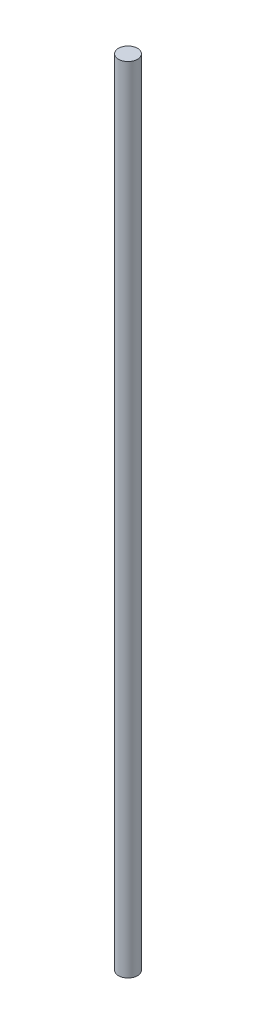
ISO-10303-21;
HEADER;
FILE_DESCRIPTION(('STEP AP214'),'2;1');
FILE_NAME('part.step','',(''),(''),'','','');
FILE_SCHEMA(('AUTOMOTIVE_DESIGN { 1 0 10303 214 1 1 1 1 }'));
ENDSEC;
DATA;
#1=APPLICATION_CONTEXT('core data for automotive mechanical design processes');
#2=APPLICATION_PROTOCOL_DEFINITION('international standard','automotive_design',2000,#1);
#3=PRODUCT_CONTEXT('',#1,'mechanical');
#4=PRODUCT('Part','Part','',(#3));
#5=PRODUCT_RELATED_PRODUCT_CATEGORY('part','',(#4));
#6=PRODUCT_DEFINITION_FORMATION('','',#4);
#7=PRODUCT_DEFINITION_CONTEXT('part definition',#1,'design');
#8=PRODUCT_DEFINITION('design','',#6,#7);
#9=PRODUCT_DEFINITION_SHAPE('','',#8);
#10=(LENGTH_UNIT() NAMED_UNIT(*) SI_UNIT(.MILLI.,.METRE.));
#11=(NAMED_UNIT(*) PLANE_ANGLE_UNIT() SI_UNIT($,.RADIAN.));
#12=(NAMED_UNIT(*) SI_UNIT($,.STERADIAN.) SOLID_ANGLE_UNIT());
#13=UNCERTAINTY_MEASURE_WITH_UNIT(LENGTH_MEASURE(1.E-05),#10,'distance_accuracy_value','');
#14=(GEOMETRIC_REPRESENTATION_CONTEXT(3) GLOBAL_UNCERTAINTY_ASSIGNED_CONTEXT((#13)) GLOBAL_UNIT_ASSIGNED_CONTEXT((#10,
#11,#12)) REPRESENTATION_CONTEXT('',''));
#15=CARTESIAN_POINT('',(0.,0.,0.));
#16=DIRECTION('',(0.,0.,1.));
#17=DIRECTION('',(1.,0.,0.));
#18=AXIS2_PLACEMENT_3D('',#15,#16,#17);
#19=CARTESIAN_POINT('',(0.,250.,0.));
#20=DIRECTION('',(0.,-1.,0.));
#21=DIRECTION('',(0.,0.,-1.));
#22=AXIS2_PLACEMENT_3D('',#19,#20,#21);
#23=CYLINDRICAL_SURFACE('',#22,3.);
#24=CARTESIAN_POINT('',(0.,250.,0.));
#25=DIRECTION('',(0.,1.,0.));
#26=DIRECTION('',(0.,0.,1.));
#27=AXIS2_PLACEMENT_3D('',#24,#25,#26);
#28=CIRCLE('',#27,3.);
#29=CARTESIAN_POINT('',(0.,250.,3.));
#30=VERTEX_POINT('',#29);
#31=EDGE_CURVE('E10',#30,#30,#28,.T.);
#32=ORIENTED_EDGE('',*,*,#31,.F.);
#33=EDGE_LOOP('',(#32));
#34=FACE_BOUND('',#33,.T.);
#35=CARTESIAN_POINT('',(0.,0.,0.));
#36=DIRECTION('',(0.,1.,0.));
#37=DIRECTION('',(0.,0.,1.));
#38=AXIS2_PLACEMENT_3D('',#35,#36,#37);
#39=CIRCLE('',#38,3.);
#40=CARTESIAN_POINT('',(0.,0.,3.));
#41=VERTEX_POINT('',#40);
#42=EDGE_CURVE('E42',#41,#41,#39,.T.);
#43=ORIENTED_EDGE('',*,*,#42,.T.);
#44=EDGE_LOOP('',(#43));
#45=FACE_BOUND('',#44,.T.);
#46=ADVANCED_FACE('F39',(#34,#45),#23,.T.);
#47=CARTESIAN_POINT('',(0.,250.,0.));
#48=DIRECTION('',(0.,1.,0.));
#49=DIRECTION('',(0.,0.,1.));
#50=AXIS2_PLACEMENT_3D('',#47,#48,#49);
#51=PLANE('',#50);
#52=ORIENTED_EDGE('',*,*,#31,.T.);
#53=EDGE_LOOP('',(#52));
#54=FACE_BOUND('',#53,.T.);
#55=ADVANCED_FACE('F56',(#54),#51,.T.);
#56=CARTESIAN_POINT('',(0.,0.,0.));
#57=DIRECTION('',(0.,1.,0.));
#58=DIRECTION('',(0.,0.,1.));
#59=AXIS2_PLACEMENT_3D('',#56,#57,#58);
#60=PLANE('',#59);
#61=ORIENTED_EDGE('',*,*,#42,.F.);
#62=EDGE_LOOP('',(#61));
#63=FACE_BOUND('',#62,.T.);
#64=ADVANCED_FACE('F54',(#63),#60,.F.);
#65=CLOSED_SHELL('',(#46,#55,#64));
#66=MANIFOLD_SOLID_BREP('B2',#65);
#67=ADVANCED_BREP_SHAPE_REPRESENTATION('',(#18,#66),#14);
#68=SHAPE_DEFINITION_REPRESENTATION(#9,#67);
ENDSEC;
END-ISO-10303-21;
